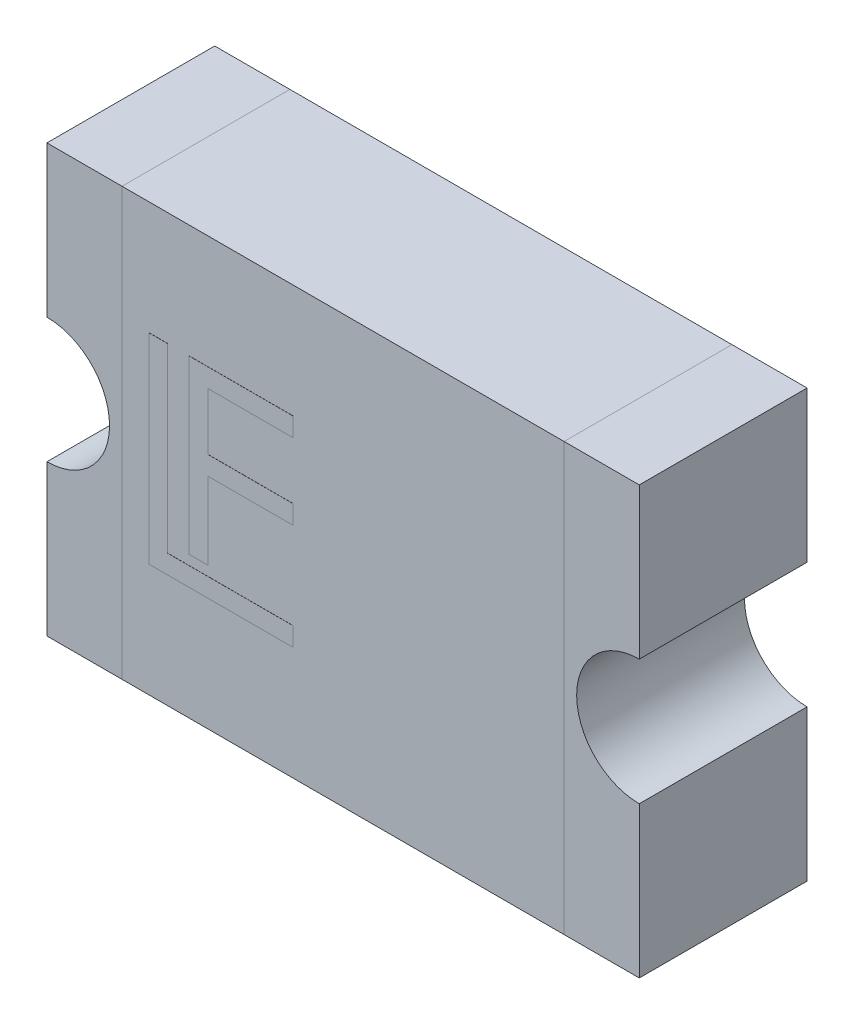
ISO-10303-21;
HEADER;
FILE_DESCRIPTION(('STEP AP214'),'2;1');
FILE_NAME('part.step','',(''),(''),'','','');
FILE_SCHEMA(('AUTOMOTIVE_DESIGN { 1 0 10303 214 1 1 1 1 }'));
ENDSEC;
DATA;
#1=APPLICATION_CONTEXT('core data for automotive mechanical design processes');
#2=APPLICATION_PROTOCOL_DEFINITION('international standard','automotive_design',2000,#1);
#3=PRODUCT_CONTEXT('',#1,'mechanical');
#4=PRODUCT('Part','Part','',(#3));
#5=PRODUCT_RELATED_PRODUCT_CATEGORY('part','',(#4));
#6=PRODUCT_DEFINITION_FORMATION('','',#4);
#7=PRODUCT_DEFINITION_CONTEXT('part definition',#1,'design');
#8=PRODUCT_DEFINITION('design','',#6,#7);
#9=PRODUCT_DEFINITION_SHAPE('','',#8);
#10=(LENGTH_UNIT() NAMED_UNIT(*) SI_UNIT(.MILLI.,.METRE.));
#11=(NAMED_UNIT(*) PLANE_ANGLE_UNIT() SI_UNIT($,.RADIAN.));
#12=(NAMED_UNIT(*) SI_UNIT($,.STERADIAN.) SOLID_ANGLE_UNIT());
#13=UNCERTAINTY_MEASURE_WITH_UNIT(LENGTH_MEASURE(1.E-05),#10,'distance_accuracy_value','');
#14=(GEOMETRIC_REPRESENTATION_CONTEXT(3) GLOBAL_UNCERTAINTY_ASSIGNED_CONTEXT((#13)) GLOBAL_UNIT_ASSIGNED_CONTEXT((#10,
#11,#12)) REPRESENTATION_CONTEXT('',''));
#15=CARTESIAN_POINT('',(0.,0.,0.));
#16=DIRECTION('',(0.,0.,1.));
#17=DIRECTION('',(1.,0.,0.));
#18=AXIS2_PLACEMENT_3D('',#15,#16,#17);
#19=CARTESIAN_POINT('',(-2.365,1.705,1.34));
#20=DIRECTION('',(1.,0.,0.));
#21=DIRECTION('',(0.,0.,-1.));
#22=AXIS2_PLACEMENT_3D('',#19,#20,#21);
#23=PLANE('',#22);
#24=DIRECTION('',(0.,0.,-1.));
#25=VECTOR('',#24,1.);
#26=CARTESIAN_POINT('',(-2.365,0.5,1.34));
#27=LINE('',#26,#25);
#28=CARTESIAN_POINT('',(-2.365,0.5,0.));
#29=VERTEX_POINT('',#28);
#30=CARTESIAN_POINT('',(-2.365,0.5,1.34));
#31=VERTEX_POINT('',#30);
#32=EDGE_CURVE('P0_E84',#29,#31,#27,.F.);
#33=ORIENTED_EDGE('',*,*,#32,.T.);
#34=DIRECTION('',(0.,1.,0.));
#35=VECTOR('',#34,1.);
#36=CARTESIAN_POINT('',(-2.365,0.,1.34));
#37=LINE('',#36,#35);
#38=CARTESIAN_POINT('',(-2.365,1.705,1.34));
#39=VERTEX_POINT('',#38);
#40=EDGE_CURVE('P0_E66',#39,#31,#37,.F.);
#41=ORIENTED_EDGE('',*,*,#40,.F.);
#42=DIRECTION('',(0.,0.,-1.));
#43=VECTOR('',#42,1.);
#44=CARTESIAN_POINT('',(-2.365,1.705,1.34));
#45=LINE('',#44,#43);
#46=CARTESIAN_POINT('',(-2.365,1.705,0.));
#47=VERTEX_POINT('',#46);
#48=EDGE_CURVE('P0_E111',#39,#47,#45,.T.);
#49=ORIENTED_EDGE('',*,*,#48,.T.);
#50=DIRECTION('',(0.,1.,0.));
#51=VECTOR('',#50,1.);
#52=CARTESIAN_POINT('',(-2.365,0.,0.));
#53=LINE('',#52,#51);
#54=EDGE_CURVE('P0_E114',#47,#29,#53,.F.);
#55=ORIENTED_EDGE('',*,*,#54,.T.);
#56=EDGE_LOOP('',(#33,#41,#49,#55));
#57=FACE_BOUND('',#56,.T.);
#58=ADVANCED_FACE('P0_F17',(#57),#23,.F.);
#59=CARTESIAN_POINT('',(-2.365,0.,1.34));
#60=DIRECTION('',(0.,0.,-1.));
#61=DIRECTION('',(-1.,0.,0.));
#62=AXIS2_PLACEMENT_3D('',#59,#60,#61);
#63=CYLINDRICAL_SURFACE('',#62,0.5);
#64=DIRECTION('',(0.,0.,-1.));
#65=VECTOR('',#64,1.);
#66=CARTESIAN_POINT('',(-2.365,-0.5,1.34));
#67=LINE('',#66,#65);
#68=CARTESIAN_POINT('',(-2.365,-0.5,0.));
#69=VERTEX_POINT('',#68);
#70=CARTESIAN_POINT('',(-2.365,-0.5,1.34));
#71=VERTEX_POINT('',#70);
#72=EDGE_CURVE('P0_E76',#69,#71,#67,.F.);
#73=ORIENTED_EDGE('',*,*,#72,.T.);
#74=CARTESIAN_POINT('',(-2.365,0.,1.34));
#75=DIRECTION('',(0.,0.,-1.));
#76=DIRECTION('',(-1.,0.,0.));
#77=AXIS2_PLACEMENT_3D('',#74,#75,#76);
#78=CIRCLE('',#77,0.5);
#79=EDGE_CURVE('P0_E20',#31,#71,#78,.T.);
#80=ORIENTED_EDGE('',*,*,#79,.F.);
#81=ORIENTED_EDGE('',*,*,#32,.F.);
#82=CARTESIAN_POINT('',(-2.365,0.,0.));
#83=DIRECTION('',(0.,0.,-1.));
#84=DIRECTION('',(-1.,0.,0.));
#85=AXIS2_PLACEMENT_3D('',#82,#83,#84);
#86=CIRCLE('',#85,0.5);
#87=EDGE_CURVE('P0_E79',#29,#69,#86,.T.);
#88=ORIENTED_EDGE('',*,*,#87,.T.);
#89=EDGE_LOOP('',(#73,#80,#81,#88));
#90=FACE_BOUND('',#89,.T.);
#91=ADVANCED_FACE('P0_F77',(#90),#63,.F.);
#92=CARTESIAN_POINT('',(-2.365,-0.5,1.34));
#93=DIRECTION('',(1.,0.,0.));
#94=DIRECTION('',(0.,0.,-1.));
#95=AXIS2_PLACEMENT_3D('',#92,#93,#94);
#96=PLANE('',#95);
#97=DIRECTION('',(0.,0.,1.));
#98=VECTOR('',#97,1.);
#99=CARTESIAN_POINT('',(-2.365,-1.705,1.34));
#100=LINE('',#99,#98);
#101=CARTESIAN_POINT('',(-2.365,-1.705,0.));
#102=VERTEX_POINT('',#101);
#103=CARTESIAN_POINT('',(-2.365,-1.705,1.34));
#104=VERTEX_POINT('',#103);
#105=EDGE_CURVE('P0_E83',#102,#104,#100,.T.);
#106=ORIENTED_EDGE('',*,*,#105,.T.);
#107=DIRECTION('',(0.,1.,0.));
#108=VECTOR('',#107,1.);
#109=CARTESIAN_POINT('',(-2.365,0.,1.34));
#110=LINE('',#109,#108);
#111=EDGE_CURVE('P0_E72',#71,#104,#110,.F.);
#112=ORIENTED_EDGE('',*,*,#111,.F.);
#113=ORIENTED_EDGE('',*,*,#72,.F.);
#114=DIRECTION('',(0.,1.,0.));
#115=VECTOR('',#114,1.);
#116=CARTESIAN_POINT('',(-2.365,0.,0.));
#117=LINE('',#116,#115);
#118=EDGE_CURVE('P0_E104',#69,#102,#117,.F.);
#119=ORIENTED_EDGE('',*,*,#118,.T.);
#120=EDGE_LOOP('',(#106,#112,#113,#119));
#121=FACE_BOUND('',#120,.T.);
#122=ADVANCED_FACE('P0_F86',(#121),#96,.F.);
#123=CARTESIAN_POINT('',(-1.765,-1.705,1.34));
#124=DIRECTION('',(0.,1.,0.));
#125=DIRECTION('',(0.,0.,1.));
#126=AXIS2_PLACEMENT_3D('',#123,#124,#125);
#127=PLANE('',#126);
#128=DIRECTION('',(0.,0.,1.));
#129=VECTOR('',#128,1.);
#130=CARTESIAN_POINT('',(-1.765,-1.705,1.34));
#131=LINE('',#130,#129);
#132=CARTESIAN_POINT('',(-1.765,-1.705,0.));
#133=VERTEX_POINT('',#132);
#134=CARTESIAN_POINT('',(-1.765,-1.705,1.34));
#135=VERTEX_POINT('',#134);
#136=EDGE_CURVE('P0_E118',#133,#135,#131,.T.);
#137=ORIENTED_EDGE('',*,*,#136,.T.);
#138=DIRECTION('',(1.,0.,0.));
#139=VECTOR('',#138,1.);
#140=CARTESIAN_POINT('',(-2.365,-1.705,1.34));
#141=LINE('',#140,#139);
#142=EDGE_CURVE('P0_E88',#104,#135,#141,.T.);
#143=ORIENTED_EDGE('',*,*,#142,.F.);
#144=ORIENTED_EDGE('',*,*,#105,.F.);
#145=DIRECTION('',(1.,0.,0.));
#146=VECTOR('',#145,1.);
#147=CARTESIAN_POINT('',(-2.365,-1.705,0.));
#148=LINE('',#147,#146);
#149=EDGE_CURVE('P0_E101',#102,#133,#148,.T.);
#150=ORIENTED_EDGE('',*,*,#149,.T.);
#151=EDGE_LOOP('',(#137,#143,#144,#150));
#152=FACE_BOUND('',#151,.T.);
#153=ADVANCED_FACE('P0_F142',(#152),#127,.F.);
#154=CARTESIAN_POINT('',(-2.365,0.,1.34));
#155=DIRECTION('',(0.,0.,1.));
#156=DIRECTION('',(1.,0.,0.));
#157=AXIS2_PLACEMENT_3D('',#154,#155,#156);
#158=PLANE('',#157);
#159=ORIENTED_EDGE('',*,*,#142,.T.);
#160=DIRECTION('',(0.,-1.,0.));
#161=VECTOR('',#160,1.);
#162=CARTESIAN_POINT('',(-1.765,-1.705,1.34));
#163=LINE('',#162,#161);
#164=CARTESIAN_POINT('',(-1.765,1.705,1.34));
#165=VERTEX_POINT('',#164);
#166=EDGE_CURVE('P0_E126',#135,#165,#163,.F.);
#167=ORIENTED_EDGE('',*,*,#166,.T.);
#168=DIRECTION('',(1.,0.,0.));
#169=VECTOR('',#168,1.);
#170=CARTESIAN_POINT('',(-1.765,1.705,1.34));
#171=LINE('',#170,#169);
#172=EDGE_CURVE('P0_E90',#165,#39,#171,.F.);
#173=ORIENTED_EDGE('',*,*,#172,.T.);
#174=ORIENTED_EDGE('',*,*,#40,.T.);
#175=ORIENTED_EDGE('',*,*,#79,.T.);
#176=ORIENTED_EDGE('',*,*,#111,.T.);
#177=EDGE_LOOP('',(#159,#167,#173,#174,#175,#176));
#178=FACE_BOUND('',#177,.T.);
#179=ADVANCED_FACE('P0_F70',(#178),#158,.T.);
#180=CARTESIAN_POINT('',(-1.765,1.705,1.34));
#181=DIRECTION('',(0.,-1.,0.));
#182=DIRECTION('',(0.,0.,-1.));
#183=AXIS2_PLACEMENT_3D('',#180,#181,#182);
#184=PLANE('',#183);
#185=ORIENTED_EDGE('',*,*,#48,.F.);
#186=ORIENTED_EDGE('',*,*,#172,.F.);
#187=DIRECTION('',(0.,0.,1.));
#188=VECTOR('',#187,1.);
#189=CARTESIAN_POINT('',(-1.765,1.705,1.34));
#190=LINE('',#189,#188);
#191=CARTESIAN_POINT('',(-1.765,1.705,0.));
#192=VERTEX_POINT('',#191);
#193=EDGE_CURVE('P0_E26',#165,#192,#190,.F.);
#194=ORIENTED_EDGE('',*,*,#193,.T.);
#195=DIRECTION('',(1.,0.,0.));
#196=VECTOR('',#195,1.);
#197=CARTESIAN_POINT('',(-2.365,1.705,0.));
#198=LINE('',#197,#196);
#199=EDGE_CURVE('P0_E34',#192,#47,#198,.F.);
#200=ORIENTED_EDGE('',*,*,#199,.T.);
#201=EDGE_LOOP('',(#185,#186,#194,#200));
#202=FACE_BOUND('',#201,.T.);
#203=ADVANCED_FACE('P0_F150',(#202),#184,.F.);
#204=CARTESIAN_POINT('',(-2.365,0.,0.));
#205=DIRECTION('',(0.,0.,1.));
#206=DIRECTION('',(1.,0.,0.));
#207=AXIS2_PLACEMENT_3D('',#204,#205,#206);
#208=PLANE('',#207);
#209=DIRECTION('',(0.,-1.,0.));
#210=VECTOR('',#209,1.);
#211=CARTESIAN_POINT('',(-1.765,-1.705,0.));
#212=LINE('',#211,#210);
#213=EDGE_CURVE('P0_E11',#192,#133,#212,.T.);
#214=ORIENTED_EDGE('',*,*,#213,.T.);
#215=ORIENTED_EDGE('',*,*,#149,.F.);
#216=ORIENTED_EDGE('',*,*,#118,.F.);
#217=ORIENTED_EDGE('',*,*,#87,.F.);
#218=ORIENTED_EDGE('',*,*,#54,.F.);
#219=ORIENTED_EDGE('',*,*,#199,.F.);
#220=EDGE_LOOP('',(#214,#215,#216,#217,#218,#219));
#221=FACE_BOUND('',#220,.T.);
#222=ADVANCED_FACE('P0_F151',(#221),#208,.F.);
#223=CARTESIAN_POINT('',(-1.765,-1.705,1.34));
#224=DIRECTION('',(-1.,0.,0.));
#225=DIRECTION('',(0.,-1.,0.));
#226=AXIS2_PLACEMENT_3D('',#223,#224,#225);
#227=PLANE('',#226);
#228=ORIENTED_EDGE('',*,*,#193,.F.);
#229=ORIENTED_EDGE('',*,*,#166,.F.);
#230=ORIENTED_EDGE('',*,*,#136,.F.);
#231=ORIENTED_EDGE('',*,*,#213,.F.);
#232=EDGE_LOOP('',(#228,#229,#230,#231));
#233=FACE_BOUND('',#232,.T.);
#234=ADVANCED_FACE('P0_F147',(#233),#227,.F.);
#235=CLOSED_SHELL('',(#58,#91,#122,#153,#179,#203,#222,#234));
#236=MANIFOLD_SOLID_BREP('P0_B1',#235);
#237=CARTESIAN_POINT('',(-1.765,-1.705,0.));
#238=DIRECTION('',(0.,0.,1.));
#239=DIRECTION('',(1.,0.,0.));
#240=AXIS2_PLACEMENT_3D('',#237,#238,#239);
#241=PLANE('',#240);
#242=DIRECTION('',(1.,0.,0.));
#243=VECTOR('',#242,1.);
#244=CARTESIAN_POINT('',(-1.765,1.705,0.));
#245=LINE('',#244,#243);
#246=CARTESIAN_POINT('',(-1.765,1.705,0.));
#247=VERTEX_POINT('',#246);
#248=CARTESIAN_POINT('',(1.765,1.705,0.));
#249=VERTEX_POINT('',#248);
#250=EDGE_CURVE('P1_E81',#247,#249,#245,.T.);
#251=ORIENTED_EDGE('',*,*,#250,.T.);
#252=DIRECTION('',(0.,-1.,0.));
#253=VECTOR('',#252,1.);
#254=CARTESIAN_POINT('',(1.765,1.705,0.));
#255=LINE('',#254,#253);
#256=CARTESIAN_POINT('',(1.765,-1.705,0.));
#257=VERTEX_POINT('',#256);
#258=EDGE_CURVE('P1_E68',#249,#257,#255,.T.);
#259=ORIENTED_EDGE('',*,*,#258,.T.);
#260=DIRECTION('',(1.,0.,0.));
#261=VECTOR('',#260,1.);
#262=CARTESIAN_POINT('',(-1.765,-1.705,0.));
#263=LINE('',#262,#261);
#264=CARTESIAN_POINT('',(-1.765,-1.705,0.));
#265=VERTEX_POINT('',#264);
#266=EDGE_CURVE('P1_E55',#257,#265,#263,.F.);
#267=ORIENTED_EDGE('',*,*,#266,.T.);
#268=DIRECTION('',(0.,1.,0.));
#269=VECTOR('',#268,1.);
#270=CARTESIAN_POINT('',(-1.765,1.705,0.));
#271=LINE('',#270,#269);
#272=EDGE_CURVE('P1_E20',#265,#247,#271,.T.);
#273=ORIENTED_EDGE('',*,*,#272,.T.);
#274=EDGE_LOOP('',(#251,#259,#267,#273));
#275=FACE_BOUND('',#274,.T.);
#276=ADVANCED_FACE('P1_F17',(#275),#241,.F.);
#277=CARTESIAN_POINT('',(-1.765,1.705,1.34));
#278=DIRECTION('',(1.,0.,0.));
#279=DIRECTION('',(0.,1.,0.));
#280=AXIS2_PLACEMENT_3D('',#277,#278,#279);
#281=PLANE('',#280);
#282=DIRECTION('',(0.,0.,1.));
#283=VECTOR('',#282,1.);
#284=CARTESIAN_POINT('',(-1.765,-1.705,1.34));
#285=LINE('',#284,#283);
#286=CARTESIAN_POINT('',(-1.765,-1.705,1.34));
#287=VERTEX_POINT('',#286);
#288=EDGE_CURVE('P1_E61',#265,#287,#285,.T.);
#289=ORIENTED_EDGE('',*,*,#288,.T.);
#290=DIRECTION('',(0.,1.,0.));
#291=VECTOR('',#290,1.);
#292=CARTESIAN_POINT('',(-1.765,-1.705,1.34));
#293=LINE('',#292,#291);
#294=CARTESIAN_POINT('',(-1.765,1.705,1.34));
#295=VERTEX_POINT('',#294);
#296=EDGE_CURVE('P1_E83',#295,#287,#293,.F.);
#297=ORIENTED_EDGE('',*,*,#296,.F.);
#298=DIRECTION('',(0.,0.,-1.));
#299=VECTOR('',#298,1.);
#300=CARTESIAN_POINT('',(-1.765,1.705,1.34));
#301=LINE('',#300,#299);
#302=EDGE_CURVE('P1_E64',#295,#247,#301,.T.);
#303=ORIENTED_EDGE('',*,*,#302,.T.);
#304=ORIENTED_EDGE('',*,*,#272,.F.);
#305=EDGE_LOOP('',(#289,#297,#303,#304));
#306=FACE_BOUND('',#305,.T.);
#307=ADVANCED_FACE('P1_F60',(#306),#281,.F.);
#308=CARTESIAN_POINT('',(-1.765,-1.705,1.34));
#309=DIRECTION('',(0.,1.,0.));
#310=DIRECTION('',(0.,0.,1.));
#311=AXIS2_PLACEMENT_3D('',#308,#309,#310);
#312=PLANE('',#311);
#313=DIRECTION('',(0.,0.,1.));
#314=VECTOR('',#313,1.);
#315=CARTESIAN_POINT('',(1.765,-1.705,1.34));
#316=LINE('',#315,#314);
#317=CARTESIAN_POINT('',(1.765,-1.705,1.34));
#318=VERTEX_POINT('',#317);
#319=EDGE_CURVE('P1_E70',#257,#318,#316,.T.);
#320=ORIENTED_EDGE('',*,*,#319,.T.);
#321=DIRECTION('',(1.,0.,0.));
#322=VECTOR('',#321,1.);
#323=CARTESIAN_POINT('',(-1.765,-1.705,1.34));
#324=LINE('',#323,#322);
#325=EDGE_CURVE('P1_E74',#287,#318,#324,.T.);
#326=ORIENTED_EDGE('',*,*,#325,.F.);
#327=ORIENTED_EDGE('',*,*,#288,.F.);
#328=ORIENTED_EDGE('',*,*,#266,.F.);
#329=EDGE_LOOP('',(#320,#326,#327,#328));
#330=FACE_BOUND('',#329,.T.);
#331=ADVANCED_FACE('P1_F72',(#330),#312,.F.);
#332=CARTESIAN_POINT('',(1.765,1.705,1.34));
#333=DIRECTION('',(-1.,0.,0.));
#334=DIRECTION('',(0.,-1.,0.));
#335=AXIS2_PLACEMENT_3D('',#332,#333,#334);
#336=PLANE('',#335);
#337=DIRECTION('',(0.,0.,-1.));
#338=VECTOR('',#337,1.);
#339=CARTESIAN_POINT('',(1.765,1.705,1.34));
#340=LINE('',#339,#338);
#341=CARTESIAN_POINT('',(1.765,1.705,1.34));
#342=VERTEX_POINT('',#341);
#343=EDGE_CURVE('P1_E35',#249,#342,#340,.F.);
#344=ORIENTED_EDGE('',*,*,#343,.T.);
#345=DIRECTION('',(0.,1.,0.));
#346=VECTOR('',#345,1.);
#347=CARTESIAN_POINT('',(1.765,-1.705,1.34));
#348=LINE('',#347,#346);
#349=EDGE_CURVE('P1_E26',#318,#342,#348,.T.);
#350=ORIENTED_EDGE('',*,*,#349,.F.);
#351=ORIENTED_EDGE('',*,*,#319,.F.);
#352=ORIENTED_EDGE('',*,*,#258,.F.);
#353=EDGE_LOOP('',(#344,#350,#351,#352));
#354=FACE_BOUND('',#353,.T.);
#355=ADVANCED_FACE('P1_F89',(#354),#336,.F.);
#356=CARTESIAN_POINT('',(-1.765,1.705,1.34));
#357=DIRECTION('',(0.,-1.,0.));
#358=DIRECTION('',(0.,0.,-1.));
#359=AXIS2_PLACEMENT_3D('',#356,#357,#358);
#360=PLANE('',#359);
#361=ORIENTED_EDGE('',*,*,#302,.F.);
#362=DIRECTION('',(1.,0.,0.));
#363=VECTOR('',#362,1.);
#364=CARTESIAN_POINT('',(-1.765,1.705,1.34));
#365=LINE('',#364,#363);
#366=EDGE_CURVE('P1_E11',#342,#295,#365,.F.);
#367=ORIENTED_EDGE('',*,*,#366,.F.);
#368=ORIENTED_EDGE('',*,*,#343,.F.);
#369=ORIENTED_EDGE('',*,*,#250,.F.);
#370=EDGE_LOOP('',(#361,#367,#368,#369));
#371=FACE_BOUND('',#370,.T.);
#372=ADVANCED_FACE('P1_F91',(#371),#360,.F.);
#373=CARTESIAN_POINT('',(-1.765,-1.705,1.34));
#374=DIRECTION('',(0.,0.,1.));
#375=DIRECTION('',(1.,0.,0.));
#376=AXIS2_PLACEMENT_3D('',#373,#374,#375);
#377=PLANE('',#376);
#378=ORIENTED_EDGE('',*,*,#349,.T.);
#379=ORIENTED_EDGE('',*,*,#366,.T.);
#380=ORIENTED_EDGE('',*,*,#296,.T.);
#381=ORIENTED_EDGE('',*,*,#325,.T.);
#382=EDGE_LOOP('',(#378,#379,#380,#381));
#383=FACE_BOUND('',#382,.T.);
#384=ADVANCED_FACE('P1_F88',(#383),#377,.T.);
#385=CLOSED_SHELL('',(#276,#307,#331,#355,#372,#384));
#386=MANIFOLD_SOLID_BREP('P1_B1',#385);
#387=CARTESIAN_POINT('',(-0.4,0.8,1.34));
#388=DIRECTION('',(0.,0.,-1.));
#389=DIRECTION('',(-1.,0.,0.));
#390=AXIS2_PLACEMENT_3D('',#387,#388,#389);
#391=PLANE('',#390);
#392=DIRECTION('',(1.,0.,0.));
#393=VECTOR('',#392,1.);
#394=CARTESIAN_POINT('',(-1.228413287018,-0.571292642216,1.34));
#395=LINE('',#394,#393);
#396=CARTESIAN_POINT('',(-1.078413287018,-0.571292642216,1.34));
#397=VERTEX_POINT('',#396);
#398=CARTESIAN_POINT('',(-1.228413287018,-0.571292642216,1.34));
#399=VERTEX_POINT('',#398);
#400=EDGE_CURVE('P2_E126',#397,#399,#395,.F.);
#401=ORIENTED_EDGE('',*,*,#400,.T.);
#402=DIRECTION('',(0.,1.,0.));
#403=VECTOR('',#402,1.);
#404=CARTESIAN_POINT('',(-1.228413287018,0.8,1.34));
#405=LINE('',#404,#403);
#406=CARTESIAN_POINT('',(-1.228413287018,0.8,1.34));
#407=VERTEX_POINT('',#406);
#408=EDGE_CURVE('P2_E119',#399,#407,#405,.T.);
#409=ORIENTED_EDGE('',*,*,#408,.T.);
#410=DIRECTION('',(1.,0.,0.));
#411=VECTOR('',#410,1.);
#412=CARTESIAN_POINT('',(-1.228413287018,0.8,1.34));
#413=LINE('',#412,#411);
#414=CARTESIAN_POINT('',(-0.4,0.8,1.34));
#415=VERTEX_POINT('',#414);
#416=EDGE_CURVE('P2_E113',#407,#415,#413,.T.);
#417=ORIENTED_EDGE('',*,*,#416,.T.);
#418=DIRECTION('',(0.,-1.,0.));
#419=VECTOR('',#418,1.);
#420=CARTESIAN_POINT('',(-0.4,0.8,1.34));
#421=LINE('',#420,#419);
#422=CARTESIAN_POINT('',(-0.4,0.65,1.34));
#423=VERTEX_POINT('',#422);
#424=EDGE_CURVE('P2_E99',#415,#423,#421,.T.);
#425=ORIENTED_EDGE('',*,*,#424,.T.);
#426=DIRECTION('',(1.,0.,0.));
#427=VECTOR('',#426,1.);
#428=CARTESIAN_POINT('',(-1.078413287018,0.65,1.34));
#429=LINE('',#428,#427);
#430=CARTESIAN_POINT('',(-1.078413287018,0.65,1.34));
#431=VERTEX_POINT('',#430);
#432=EDGE_CURVE('P2_E96',#423,#431,#429,.F.);
#433=ORIENTED_EDGE('',*,*,#432,.T.);
#434=DIRECTION('',(0.,1.,0.));
#435=VECTOR('',#434,1.);
#436=CARTESIAN_POINT('',(-1.078413287018,0.19403873626,1.34));
#437=LINE('',#436,#435);
#438=CARTESIAN_POINT('',(-1.078413287018,0.19403873626,1.34));
#439=VERTEX_POINT('',#438);
#440=EDGE_CURVE('P2_E153',#431,#439,#437,.F.);
#441=ORIENTED_EDGE('',*,*,#440,.T.);
#442=DIRECTION('',(1.,0.,0.));
#443=VECTOR('',#442,1.);
#444=CARTESIAN_POINT('',(-1.078413287018,0.19403873626,1.34));
#445=LINE('',#444,#443);
#446=CARTESIAN_POINT('',(-0.4,0.19403873626,1.34));
#447=VERTEX_POINT('',#446);
#448=EDGE_CURVE('P2_E149',#439,#447,#445,.T.);
#449=ORIENTED_EDGE('',*,*,#448,.T.);
#450=DIRECTION('',(0.,1.,0.));
#451=VECTOR('',#450,1.);
#452=CARTESIAN_POINT('',(-0.4,0.19403873626,1.34));
#453=LINE('',#452,#451);
#454=CARTESIAN_POINT('',(-0.4,0.04403873625961,1.34));
#455=VERTEX_POINT('',#454);
#456=EDGE_CURVE('P2_E144',#447,#455,#453,.F.);
#457=ORIENTED_EDGE('',*,*,#456,.T.);
#458=DIRECTION('',(1.,0.,0.));
#459=VECTOR('',#458,1.);
#460=CARTESIAN_POINT('',(-0.4,0.04403873625961,1.34));
#461=LINE('',#460,#459);
#462=CARTESIAN_POINT('',(-1.078413287018,0.04403873625961,1.34));
#463=VERTEX_POINT('',#462);
#464=EDGE_CURVE('P2_E138',#455,#463,#461,.F.);
#465=ORIENTED_EDGE('',*,*,#464,.T.);
#466=DIRECTION('',(0.,1.,0.));
#467=VECTOR('',#466,1.);
#468=CARTESIAN_POINT('',(-1.078413287018,0.04403873625961,1.34));
#469=LINE('',#468,#467);
#470=EDGE_CURVE('P2_E132',#463,#397,#469,.F.);
#471=ORIENTED_EDGE('',*,*,#470,.T.);
#472=EDGE_LOOP('',(#401,#409,#417,#425,#433,#441,#449,#457,#465,#471));
#473=FACE_BOUND('',#472,.T.);
#474=ADVANCED_FACE('P2_F17',(#473),#391,.T.);
#475=CARTESIAN_POINT('',(-0.4,0.8,1.341));
#476=DIRECTION('',(-1.,0.,0.));
#477=DIRECTION('',(0.,-1.,0.));
#478=AXIS2_PLACEMENT_3D('',#475,#476,#477);
#479=PLANE('',#478);
#480=DIRECTION('',(0.,0.,1.));
#481=VECTOR('',#480,1.);
#482=CARTESIAN_POINT('',(-0.4,0.8,1.341));
#483=LINE('',#482,#481);
#484=CARTESIAN_POINT('',(-0.4,0.8,1.341));
#485=VERTEX_POINT('',#484);
#486=EDGE_CURVE('P2_E112',#415,#485,#483,.T.);
#487=ORIENTED_EDGE('',*,*,#486,.T.);
#488=DIRECTION('',(0.,1.,0.));
#489=VECTOR('',#488,1.);
#490=CARTESIAN_POINT('',(-0.4,0.8,1.341));
#491=LINE('',#490,#489);
#492=CARTESIAN_POINT('',(-0.4,0.65,1.341));
#493=VERTEX_POINT('',#492);
#494=EDGE_CURVE('P2_E104',#485,#493,#491,.F.);
#495=ORIENTED_EDGE('',*,*,#494,.T.);
#496=DIRECTION('',(0.,0.,1.));
#497=VECTOR('',#496,1.);
#498=CARTESIAN_POINT('',(-0.4,0.65,1.341));
#499=LINE('',#498,#497);
#500=EDGE_CURVE('P2_E20',#493,#423,#499,.F.);
#501=ORIENTED_EDGE('',*,*,#500,.T.);
#502=ORIENTED_EDGE('',*,*,#424,.F.);
#503=EDGE_LOOP('',(#487,#495,#501,#502));
#504=FACE_BOUND('',#503,.T.);
#505=ADVANCED_FACE('P2_F110',(#504),#479,.F.);
#506=CARTESIAN_POINT('',(-1.078413287018,0.65,1.341));
#507=DIRECTION('',(0.,1.,0.));
#508=DIRECTION('',(0.,0.,1.));
#509=AXIS2_PLACEMENT_3D('',#506,#507,#508);
#510=PLANE('',#509);
#511=ORIENTED_EDGE('',*,*,#500,.F.);
#512=DIRECTION('',(-1.,0.,0.));
#513=VECTOR('',#512,1.);
#514=CARTESIAN_POINT('',(-0.4,0.65,1.341));
#515=LINE('',#514,#513);
#516=CARTESIAN_POINT('',(-1.078413287018,0.65,1.341));
#517=VERTEX_POINT('',#516);
#518=EDGE_CURVE('P2_E95',#493,#517,#515,.T.);
#519=ORIENTED_EDGE('',*,*,#518,.T.);
#520=DIRECTION('',(0.,0.,1.));
#521=VECTOR('',#520,1.);
#522=CARTESIAN_POINT('',(-1.078413287018,0.65,1.341));
#523=LINE('',#522,#521);
#524=EDGE_CURVE('P2_E154',#517,#431,#523,.F.);
#525=ORIENTED_EDGE('',*,*,#524,.T.);
#526=ORIENTED_EDGE('',*,*,#432,.F.);
#527=EDGE_LOOP('',(#511,#519,#525,#526));
#528=FACE_BOUND('',#527,.T.);
#529=ADVANCED_FACE('P2_F93',(#528),#510,.F.);
#530=CARTESIAN_POINT('',(-1.078413287018,0.19403873626,1.341));
#531=DIRECTION('',(-1.,0.,0.));
#532=DIRECTION('',(0.,0.,1.));
#533=AXIS2_PLACEMENT_3D('',#530,#531,#532);
#534=PLANE('',#533);
#535=ORIENTED_EDGE('',*,*,#524,.F.);
#536=DIRECTION('',(0.,1.,0.));
#537=VECTOR('',#536,1.);
#538=CARTESIAN_POINT('',(-1.078413287018,0.8,1.341));
#539=LINE('',#538,#537);
#540=CARTESIAN_POINT('',(-1.078413287018,0.19403873626,1.341));
#541=VERTEX_POINT('',#540);
#542=EDGE_CURVE('P2_E108',#517,#541,#539,.F.);
#543=ORIENTED_EDGE('',*,*,#542,.T.);
#544=DIRECTION('',(0.,0.,1.));
#545=VECTOR('',#544,1.);
#546=CARTESIAN_POINT('',(-1.078413287018,0.19403873626,1.341));
#547=LINE('',#546,#545);
#548=EDGE_CURVE('P2_E151',#541,#439,#547,.F.);
#549=ORIENTED_EDGE('',*,*,#548,.T.);
#550=ORIENTED_EDGE('',*,*,#440,.F.);
#551=EDGE_LOOP('',(#535,#543,#549,#550));
#552=FACE_BOUND('',#551,.T.);
#553=ADVANCED_FACE('P2_F174',(#552),#534,.F.);
#554=CARTESIAN_POINT('',(-1.078413287018,0.19403873626,1.341));
#555=DIRECTION('',(0.,-1.,0.));
#556=DIRECTION('',(1.,0.,0.));
#557=AXIS2_PLACEMENT_3D('',#554,#555,#556);
#558=PLANE('',#557);
#559=ORIENTED_EDGE('',*,*,#548,.F.);
#560=DIRECTION('',(-1.,0.,0.));
#561=VECTOR('',#560,1.);
#562=CARTESIAN_POINT('',(-0.4,0.19403873626,1.341));
#563=LINE('',#562,#561);
#564=CARTESIAN_POINT('',(-0.4,0.19403873626,1.341));
#565=VERTEX_POINT('',#564);
#566=EDGE_CURVE('P2_E143',#541,#565,#563,.F.);
#567=ORIENTED_EDGE('',*,*,#566,.T.);
#568=DIRECTION('',(0.,0.,1.));
#569=VECTOR('',#568,1.);
#570=CARTESIAN_POINT('',(-0.4,0.19403873626,1.341));
#571=LINE('',#570,#569);
#572=EDGE_CURVE('P2_E146',#565,#447,#571,.F.);
#573=ORIENTED_EDGE('',*,*,#572,.T.);
#574=ORIENTED_EDGE('',*,*,#448,.F.);
#575=EDGE_LOOP('',(#559,#567,#573,#574));
#576=FACE_BOUND('',#575,.T.);
#577=ADVANCED_FACE('P2_F179',(#576),#558,.F.);
#578=CARTESIAN_POINT('',(-0.4,0.19403873626,1.341));
#579=DIRECTION('',(-1.,0.,0.));
#580=DIRECTION('',(0.,0.,1.));
#581=AXIS2_PLACEMENT_3D('',#578,#579,#580);
#582=PLANE('',#581);
#583=ORIENTED_EDGE('',*,*,#572,.F.);
#584=DIRECTION('',(0.,1.,0.));
#585=VECTOR('',#584,1.);
#586=CARTESIAN_POINT('',(-0.4,0.8,1.341));
#587=LINE('',#586,#585);
#588=CARTESIAN_POINT('',(-0.4,0.04403873625961,1.341));
#589=VERTEX_POINT('',#588);
#590=EDGE_CURVE('P2_E137',#565,#589,#587,.F.);
#591=ORIENTED_EDGE('',*,*,#590,.T.);
#592=DIRECTION('',(0.,0.,1.));
#593=VECTOR('',#592,1.);
#594=CARTESIAN_POINT('',(-0.4,0.04403873625961,1.341));
#595=LINE('',#594,#593);
#596=EDGE_CURVE('P2_E140',#589,#455,#595,.F.);
#597=ORIENTED_EDGE('',*,*,#596,.T.);
#598=ORIENTED_EDGE('',*,*,#456,.F.);
#599=EDGE_LOOP('',(#583,#591,#597,#598));
#600=FACE_BOUND('',#599,.T.);
#601=ADVANCED_FACE('P2_F182',(#600),#582,.F.);
#602=CARTESIAN_POINT('',(-0.4,0.04403873625961,1.341));
#603=DIRECTION('',(0.,1.,0.));
#604=DIRECTION('',(0.,0.,1.));
#605=AXIS2_PLACEMENT_3D('',#602,#603,#604);
#606=PLANE('',#605);
#607=ORIENTED_EDGE('',*,*,#596,.F.);
#608=DIRECTION('',(-1.,0.,0.));
#609=VECTOR('',#608,1.);
#610=CARTESIAN_POINT('',(-0.4,0.04403873625961,1.341));
#611=LINE('',#610,#609);
#612=CARTESIAN_POINT('',(-1.078413287018,0.04403873625961,1.341));
#613=VERTEX_POINT('',#612);
#614=EDGE_CURVE('P2_E131',#589,#613,#611,.T.);
#615=ORIENTED_EDGE('',*,*,#614,.T.);
#616=DIRECTION('',(0.,0.,1.));
#617=VECTOR('',#616,1.);
#618=CARTESIAN_POINT('',(-1.078413287018,0.04403873625961,1.341));
#619=LINE('',#618,#617);
#620=EDGE_CURVE('P2_E134',#613,#463,#619,.F.);
#621=ORIENTED_EDGE('',*,*,#620,.T.);
#622=ORIENTED_EDGE('',*,*,#464,.F.);
#623=EDGE_LOOP('',(#607,#615,#621,#622));
#624=FACE_BOUND('',#623,.T.);
#625=ADVANCED_FACE('P2_F187',(#624),#606,.F.);
#626=CARTESIAN_POINT('',(-1.078413287018,0.04403873625961,1.341));
#627=DIRECTION('',(-1.,0.,0.));
#628=DIRECTION('',(0.,0.,1.));
#629=AXIS2_PLACEMENT_3D('',#626,#627,#628);
#630=PLANE('',#629);
#631=ORIENTED_EDGE('',*,*,#620,.F.);
#632=DIRECTION('',(0.,1.,0.));
#633=VECTOR('',#632,1.);
#634=CARTESIAN_POINT('',(-1.078413287018,0.8,1.341));
#635=LINE('',#634,#633);
#636=CARTESIAN_POINT('',(-1.078413287018,-0.571292642216,1.341));
#637=VERTEX_POINT('',#636);
#638=EDGE_CURVE('P2_E125',#613,#637,#635,.F.);
#639=ORIENTED_EDGE('',*,*,#638,.T.);
#640=DIRECTION('',(0.,0.,1.));
#641=VECTOR('',#640,1.);
#642=CARTESIAN_POINT('',(-1.078413287018,-0.571292642216,1.341));
#643=LINE('',#642,#641);
#644=EDGE_CURVE('P2_E128',#637,#397,#643,.F.);
#645=ORIENTED_EDGE('',*,*,#644,.T.);
#646=ORIENTED_EDGE('',*,*,#470,.F.);
#647=EDGE_LOOP('',(#631,#639,#645,#646));
#648=FACE_BOUND('',#647,.T.);
#649=ADVANCED_FACE('P2_F192',(#648),#630,.F.);
#650=CARTESIAN_POINT('',(-1.228413287018,-0.571292642216,1.341));
#651=DIRECTION('',(0.,1.,0.));
#652=DIRECTION('',(0.,0.,1.));
#653=AXIS2_PLACEMENT_3D('',#650,#651,#652);
#654=PLANE('',#653);
#655=ORIENTED_EDGE('',*,*,#644,.F.);
#656=DIRECTION('',(-1.,0.,0.));
#657=VECTOR('',#656,1.);
#658=CARTESIAN_POINT('',(-0.4,-0.571292642216,1.341));
#659=LINE('',#658,#657);
#660=CARTESIAN_POINT('',(-1.228413287018,-0.571292642216,1.341));
#661=VERTEX_POINT('',#660);
#662=EDGE_CURVE('P2_E122',#637,#661,#659,.T.);
#663=ORIENTED_EDGE('',*,*,#662,.T.);
#664=DIRECTION('',(0.,0.,1.));
#665=VECTOR('',#664,1.);
#666=CARTESIAN_POINT('',(-1.228413287018,-0.571292642216,1.341));
#667=LINE('',#666,#665);
#668=EDGE_CURVE('P2_E121',#661,#399,#667,.F.);
#669=ORIENTED_EDGE('',*,*,#668,.T.);
#670=ORIENTED_EDGE('',*,*,#400,.F.);
#671=EDGE_LOOP('',(#655,#663,#669,#670));
#672=FACE_BOUND('',#671,.T.);
#673=ADVANCED_FACE('P2_F194',(#672),#654,.F.);
#674=CARTESIAN_POINT('',(-1.228413287018,0.8,1.341));
#675=DIRECTION('',(1.,0.,0.));
#676=DIRECTION('',(0.,0.,-1.));
#677=AXIS2_PLACEMENT_3D('',#674,#675,#676);
#678=PLANE('',#677);
#679=ORIENTED_EDGE('',*,*,#668,.F.);
#680=DIRECTION('',(0.,1.,0.));
#681=VECTOR('',#680,1.);
#682=CARTESIAN_POINT('',(-1.228413287018,0.8,1.341));
#683=LINE('',#682,#681);
#684=CARTESIAN_POINT('',(-1.228413287018,0.8,1.341));
#685=VERTEX_POINT('',#684);
#686=EDGE_CURVE('P2_E26',#661,#685,#683,.T.);
#687=ORIENTED_EDGE('',*,*,#686,.T.);
#688=DIRECTION('',(0.,0.,-1.));
#689=VECTOR('',#688,1.);
#690=CARTESIAN_POINT('',(-1.228413287018,0.8,1.341));
#691=LINE('',#690,#689);
#692=EDGE_CURVE('P2_E34',#685,#407,#691,.T.);
#693=ORIENTED_EDGE('',*,*,#692,.T.);
#694=ORIENTED_EDGE('',*,*,#408,.F.);
#695=EDGE_LOOP('',(#679,#687,#693,#694));
#696=FACE_BOUND('',#695,.T.);
#697=ADVANCED_FACE('P2_F197',(#696),#678,.F.);
#698=CARTESIAN_POINT('',(-1.228413287018,0.8,1.341));
#699=DIRECTION('',(0.,-1.,0.));
#700=DIRECTION('',(0.,0.,-1.));
#701=AXIS2_PLACEMENT_3D('',#698,#699,#700);
#702=PLANE('',#701);
#703=ORIENTED_EDGE('',*,*,#692,.F.);
#704=DIRECTION('',(-1.,0.,0.));
#705=VECTOR('',#704,1.);
#706=CARTESIAN_POINT('',(-0.4,0.8,1.341));
#707=LINE('',#706,#705);
#708=EDGE_CURVE('P2_E11',#685,#485,#707,.F.);
#709=ORIENTED_EDGE('',*,*,#708,.T.);
#710=ORIENTED_EDGE('',*,*,#486,.F.);
#711=ORIENTED_EDGE('',*,*,#416,.F.);
#712=EDGE_LOOP('',(#703,#709,#710,#711));
#713=FACE_BOUND('',#712,.T.);
#714=ADVANCED_FACE('P2_F199',(#713),#702,.F.);
#715=CARTESIAN_POINT('',(-0.4,0.8,1.341));
#716=DIRECTION('',(0.,0.,-1.));
#717=DIRECTION('',(-1.,0.,0.));
#718=AXIS2_PLACEMENT_3D('',#715,#716,#717);
#719=PLANE('',#718);
#720=ORIENTED_EDGE('',*,*,#686,.F.);
#721=ORIENTED_EDGE('',*,*,#662,.F.);
#722=ORIENTED_EDGE('',*,*,#638,.F.);
#723=ORIENTED_EDGE('',*,*,#614,.F.);
#724=ORIENTED_EDGE('',*,*,#590,.F.);
#725=ORIENTED_EDGE('',*,*,#566,.F.);
#726=ORIENTED_EDGE('',*,*,#542,.F.);
#727=ORIENTED_EDGE('',*,*,#518,.F.);
#728=ORIENTED_EDGE('',*,*,#494,.F.);
#729=ORIENTED_EDGE('',*,*,#708,.F.);
#730=EDGE_LOOP('',(#720,#721,#722,#723,#724,#725,#726,#727,#728,#729));
#731=FACE_BOUND('',#730,.T.);
#732=ADVANCED_FACE('P2_F103',(#731),#719,.F.);
#733=CLOSED_SHELL('',(#474,#505,#529,#553,#577,#601,#625,#649,#673,#697,#714,#732));
#734=MANIFOLD_SOLID_BREP('P2_B1',#733);
#735=CARTESIAN_POINT('',(-1.400268296717,0.8,1.34));
#736=DIRECTION('',(0.,0.,-1.));
#737=DIRECTION('',(-1.,0.,0.));
#738=AXIS2_PLACEMENT_3D('',#735,#736,#737);
#739=PLANE('',#738);
#740=DIRECTION('',(-1.,0.,0.));
#741=VECTOR('',#740,1.);
#742=CARTESIAN_POINT('',(-1.550268296717,-0.8,1.34));
#743=LINE('',#742,#741);
#744=CARTESIAN_POINT('',(-0.4,-0.8,1.34));
#745=VERTEX_POINT('',#744);
#746=CARTESIAN_POINT('',(-1.550268296717,-0.8,1.34));
#747=VERTEX_POINT('',#746);
#748=EDGE_CURVE('P3_E100',#745,#747,#743,.T.);
#749=ORIENTED_EDGE('',*,*,#748,.T.);
#750=DIRECTION('',(0.,1.,0.));
#751=VECTOR('',#750,1.);
#752=CARTESIAN_POINT('',(-1.550268296717,0.8,1.34));
#753=LINE('',#752,#751);
#754=CARTESIAN_POINT('',(-1.550268296717,0.8,1.34));
#755=VERTEX_POINT('',#754);
#756=EDGE_CURVE('P3_E93',#747,#755,#753,.T.);
#757=ORIENTED_EDGE('',*,*,#756,.T.);
#758=DIRECTION('',(-1.,0.,0.));
#759=VECTOR('',#758,1.);
#760=CARTESIAN_POINT('',(-1.400268296717,0.8,1.34));
#761=LINE('',#760,#759);
#762=CARTESIAN_POINT('',(-1.400268296717,0.8,1.34));
#763=VERTEX_POINT('',#762);
#764=EDGE_CURVE('P3_E110',#755,#763,#761,.F.);
#765=ORIENTED_EDGE('',*,*,#764,.T.);
#766=DIRECTION('',(0.,1.,0.));
#767=VECTOR('',#766,1.);
#768=CARTESIAN_POINT('',(-1.400268296717,0.8,1.34));
#769=LINE('',#768,#767);
#770=CARTESIAN_POINT('',(-1.400268296717,-0.65,1.34));
#771=VERTEX_POINT('',#770);
#772=EDGE_CURVE('P3_E75',#763,#771,#769,.F.);
#773=ORIENTED_EDGE('',*,*,#772,.T.);
#774=DIRECTION('',(1.,0.,0.));
#775=VECTOR('',#774,1.);
#776=CARTESIAN_POINT('',(-1.400268296717,-0.65,1.34));
#777=LINE('',#776,#775);
#778=CARTESIAN_POINT('',(-0.4,-0.65,1.34));
#779=VERTEX_POINT('',#778);
#780=EDGE_CURVE('P3_E71',#771,#779,#777,.T.);
#781=ORIENTED_EDGE('',*,*,#780,.T.);
#782=DIRECTION('',(0.,-1.,0.));
#783=VECTOR('',#782,1.);
#784=CARTESIAN_POINT('',(-0.4,-0.8,1.34));
#785=LINE('',#784,#783);
#786=EDGE_CURVE('P3_E104',#779,#745,#785,.T.);
#787=ORIENTED_EDGE('',*,*,#786,.T.);
#788=EDGE_LOOP('',(#749,#757,#765,#773,#781,#787));
#789=FACE_BOUND('',#788,.T.);
#790=ADVANCED_FACE('P3_F17',(#789),#739,.T.);
#791=CARTESIAN_POINT('',(-1.400268296717,0.8,1.341));
#792=DIRECTION('',(-1.,0.,0.));
#793=DIRECTION('',(0.,0.,1.));
#794=AXIS2_PLACEMENT_3D('',#791,#792,#793);
#795=PLANE('',#794);
#796=DIRECTION('',(0.,0.,1.));
#797=VECTOR('',#796,1.);
#798=CARTESIAN_POINT('',(-1.400268296717,0.8,1.341));
#799=LINE('',#798,#797);
#800=CARTESIAN_POINT('',(-1.400268296717,0.8,1.341));
#801=VERTEX_POINT('',#800);
#802=EDGE_CURVE('P3_E88',#763,#801,#799,.T.);
#803=ORIENTED_EDGE('',*,*,#802,.T.);
#804=DIRECTION('',(0.,1.,0.));
#805=VECTOR('',#804,1.);
#806=CARTESIAN_POINT('',(-1.400268296717,0.8,1.341));
#807=LINE('',#806,#805);
#808=CARTESIAN_POINT('',(-1.400268296717,-0.65,1.341));
#809=VERTEX_POINT('',#808);
#810=EDGE_CURVE('P3_E80',#801,#809,#807,.F.);
#811=ORIENTED_EDGE('',*,*,#810,.T.);
#812=DIRECTION('',(0.,0.,1.));
#813=VECTOR('',#812,1.);
#814=CARTESIAN_POINT('',(-1.400268296717,-0.65,1.341));
#815=LINE('',#814,#813);
#816=EDGE_CURVE('P3_E20',#809,#771,#815,.F.);
#817=ORIENTED_EDGE('',*,*,#816,.T.);
#818=ORIENTED_EDGE('',*,*,#772,.F.);
#819=EDGE_LOOP('',(#803,#811,#817,#818));
#820=FACE_BOUND('',#819,.T.);
#821=ADVANCED_FACE('P3_F86',(#820),#795,.F.);
#822=CARTESIAN_POINT('',(-1.400268296717,-0.65,1.341));
#823=DIRECTION('',(0.,-1.,0.));
#824=DIRECTION('',(0.,0.,-1.));
#825=AXIS2_PLACEMENT_3D('',#822,#823,#824);
#826=PLANE('',#825);
#827=ORIENTED_EDGE('',*,*,#816,.F.);
#828=DIRECTION('',(-1.,0.,0.));
#829=VECTOR('',#828,1.);
#830=CARTESIAN_POINT('',(-1.400268296717,-0.65,1.341));
#831=LINE('',#830,#829);
#832=CARTESIAN_POINT('',(-0.4,-0.65,1.341));
#833=VERTEX_POINT('',#832);
#834=EDGE_CURVE('P3_E70',#809,#833,#831,.F.);
#835=ORIENTED_EDGE('',*,*,#834,.T.);
#836=DIRECTION('',(0.,0.,-1.));
#837=VECTOR('',#836,1.);
#838=CARTESIAN_POINT('',(-0.4,-0.65,1.341));
#839=LINE('',#838,#837);
#840=EDGE_CURVE('P3_E105',#833,#779,#839,.T.);
#841=ORIENTED_EDGE('',*,*,#840,.T.);
#842=ORIENTED_EDGE('',*,*,#780,.F.);
#843=EDGE_LOOP('',(#827,#835,#841,#842));
#844=FACE_BOUND('',#843,.T.);
#845=ADVANCED_FACE('P3_F68',(#844),#826,.F.);
#846=CARTESIAN_POINT('',(-0.4,-0.8,1.341));
#847=DIRECTION('',(-1.,0.,0.));
#848=DIRECTION('',(0.,-1.,0.));
#849=AXIS2_PLACEMENT_3D('',#846,#847,#848);
#850=PLANE('',#849);
#851=ORIENTED_EDGE('',*,*,#840,.F.);
#852=DIRECTION('',(0.,1.,0.));
#853=VECTOR('',#852,1.);
#854=CARTESIAN_POINT('',(-0.4,0.8,1.341));
#855=LINE('',#854,#853);
#856=CARTESIAN_POINT('',(-0.4,-0.8,1.341));
#857=VERTEX_POINT('',#856);
#858=EDGE_CURVE('P3_E84',#833,#857,#855,.F.);
#859=ORIENTED_EDGE('',*,*,#858,.T.);
#860=DIRECTION('',(0.,0.,1.));
#861=VECTOR('',#860,1.);
#862=CARTESIAN_POINT('',(-0.4,-0.8,1.341));
#863=LINE('',#862,#861);
#864=EDGE_CURVE('P3_E102',#857,#745,#863,.F.);
#865=ORIENTED_EDGE('',*,*,#864,.T.);
#866=ORIENTED_EDGE('',*,*,#786,.F.);
#867=EDGE_LOOP('',(#851,#859,#865,#866));
#868=FACE_BOUND('',#867,.T.);
#869=ADVANCED_FACE('P3_F118',(#868),#850,.F.);
#870=CARTESIAN_POINT('',(-1.550268296717,-0.8,1.341));
#871=DIRECTION('',(0.,1.,0.));
#872=DIRECTION('',(-1.,0.,0.));
#873=AXIS2_PLACEMENT_3D('',#870,#871,#872);
#874=PLANE('',#873);
#875=ORIENTED_EDGE('',*,*,#864,.F.);
#876=DIRECTION('',(-1.,0.,0.));
#877=VECTOR('',#876,1.);
#878=CARTESIAN_POINT('',(-1.400268296717,-0.8,1.341));
#879=LINE('',#878,#877);
#880=CARTESIAN_POINT('',(-1.550268296717,-0.8,1.341));
#881=VERTEX_POINT('',#880);
#882=EDGE_CURVE('P3_E97',#857,#881,#879,.T.);
#883=ORIENTED_EDGE('',*,*,#882,.T.);
#884=DIRECTION('',(0.,0.,1.));
#885=VECTOR('',#884,1.);
#886=CARTESIAN_POINT('',(-1.550268296717,-0.8,1.341));
#887=LINE('',#886,#885);
#888=EDGE_CURVE('P3_E96',#881,#747,#887,.F.);
#889=ORIENTED_EDGE('',*,*,#888,.T.);
#890=ORIENTED_EDGE('',*,*,#748,.F.);
#891=EDGE_LOOP('',(#875,#883,#889,#890));
#892=FACE_BOUND('',#891,.T.);
#893=ADVANCED_FACE('P3_F123',(#892),#874,.F.);
#894=CARTESIAN_POINT('',(-1.550268296717,0.8,1.341));
#895=DIRECTION('',(1.,0.,0.));
#896=DIRECTION('',(0.,1.,0.));
#897=AXIS2_PLACEMENT_3D('',#894,#895,#896);
#898=PLANE('',#897);
#899=ORIENTED_EDGE('',*,*,#888,.F.);
#900=DIRECTION('',(0.,1.,0.));
#901=VECTOR('',#900,1.);
#902=CARTESIAN_POINT('',(-1.550268296717,0.8,1.341));
#903=LINE('',#902,#901);
#904=CARTESIAN_POINT('',(-1.550268296717,0.8,1.341));
#905=VERTEX_POINT('',#904);
#906=EDGE_CURVE('P3_E26',#881,#905,#903,.T.);
#907=ORIENTED_EDGE('',*,*,#906,.T.);
#908=DIRECTION('',(0.,0.,1.));
#909=VECTOR('',#908,1.);
#910=CARTESIAN_POINT('',(-1.550268296717,0.8,1.341));
#911=LINE('',#910,#909);
#912=EDGE_CURVE('P3_E34',#905,#755,#911,.F.);
#913=ORIENTED_EDGE('',*,*,#912,.T.);
#914=ORIENTED_EDGE('',*,*,#756,.F.);
#915=EDGE_LOOP('',(#899,#907,#913,#914));
#916=FACE_BOUND('',#915,.T.);
#917=ADVANCED_FACE('P3_F126',(#916),#898,.F.);
#918=CARTESIAN_POINT('',(-1.550268296717,0.8,1.341));
#919=DIRECTION('',(0.,-1.,0.));
#920=DIRECTION('',(0.,0.,-1.));
#921=AXIS2_PLACEMENT_3D('',#918,#919,#920);
#922=PLANE('',#921);
#923=ORIENTED_EDGE('',*,*,#912,.F.);
#924=DIRECTION('',(-1.,0.,0.));
#925=VECTOR('',#924,1.);
#926=CARTESIAN_POINT('',(-1.400268296717,0.8,1.341));
#927=LINE('',#926,#925);
#928=EDGE_CURVE('P3_E11',#905,#801,#927,.F.);
#929=ORIENTED_EDGE('',*,*,#928,.T.);
#930=ORIENTED_EDGE('',*,*,#802,.F.);
#931=ORIENTED_EDGE('',*,*,#764,.F.);
#932=EDGE_LOOP('',(#923,#929,#930,#931));
#933=FACE_BOUND('',#932,.T.);
#934=ADVANCED_FACE('P3_F127',(#933),#922,.F.);
#935=CARTESIAN_POINT('',(-1.400268296717,0.8,1.341));
#936=DIRECTION('',(0.,0.,-1.));
#937=DIRECTION('',(-1.,0.,0.));
#938=AXIS2_PLACEMENT_3D('',#935,#936,#937);
#939=PLANE('',#938);
#940=ORIENTED_EDGE('',*,*,#906,.F.);
#941=ORIENTED_EDGE('',*,*,#882,.F.);
#942=ORIENTED_EDGE('',*,*,#858,.F.);
#943=ORIENTED_EDGE('',*,*,#834,.F.);
#944=ORIENTED_EDGE('',*,*,#810,.F.);
#945=ORIENTED_EDGE('',*,*,#928,.F.);
#946=EDGE_LOOP('',(#940,#941,#942,#943,#944,#945));
#947=FACE_BOUND('',#946,.T.);
#948=ADVANCED_FACE('P3_F79',(#947),#939,.F.);
#949=CLOSED_SHELL('',(#790,#821,#845,#869,#893,#917,#934,#948));
#950=MANIFOLD_SOLID_BREP('P3_B1',#949);
#951=CARTESIAN_POINT('',(2.365,-0.5,1.34));
#952=DIRECTION('',(-1.,0.,0.));
#953=DIRECTION('',(0.,0.,1.));
#954=AXIS2_PLACEMENT_3D('',#951,#952,#953);
#955=PLANE('',#954);
#956=DIRECTION('',(0.,0.,1.));
#957=VECTOR('',#956,1.);
#958=CARTESIAN_POINT('',(2.365,-0.5,1.34));
#959=LINE('',#958,#957);
#960=CARTESIAN_POINT('',(2.365,-0.5,1.34));
#961=VERTEX_POINT('',#960);
#962=CARTESIAN_POINT('',(2.365,-0.5,0.));
#963=VERTEX_POINT('',#962);
#964=EDGE_CURVE('P4_E66',#961,#963,#959,.F.);
#965=ORIENTED_EDGE('',*,*,#964,.F.);
#966=DIRECTION('',(0.,1.,0.));
#967=VECTOR('',#966,1.);
#968=CARTESIAN_POINT('',(2.365,0.,1.34));
#969=LINE('',#968,#967);
#970=CARTESIAN_POINT('',(2.365,-1.705,1.34));
#971=VERTEX_POINT('',#970);
#972=EDGE_CURVE('P4_E69',#961,#971,#969,.F.);
#973=ORIENTED_EDGE('',*,*,#972,.T.);
#974=DIRECTION('',(0.,0.,1.));
#975=VECTOR('',#974,1.);
#976=CARTESIAN_POINT('',(2.365,-1.705,1.34));
#977=LINE('',#976,#975);
#978=CARTESIAN_POINT('',(2.365,-1.705,0.));
#979=VERTEX_POINT('',#978);
#980=EDGE_CURVE('P4_E92',#971,#979,#977,.F.);
#981=ORIENTED_EDGE('',*,*,#980,.T.);
#982=DIRECTION('',(0.,1.,0.));
#983=VECTOR('',#982,1.);
#984=CARTESIAN_POINT('',(2.365,0.,0.));
#985=LINE('',#984,#983);
#986=EDGE_CURVE('P4_E71',#963,#979,#985,.F.);
#987=ORIENTED_EDGE('',*,*,#986,.F.);
#988=EDGE_LOOP('',(#965,#973,#981,#987));
#989=FACE_BOUND('',#988,.T.);
#990=ADVANCED_FACE('P4_F17',(#989),#955,.F.);
#991=CARTESIAN_POINT('',(2.365,1.705,1.34));
#992=DIRECTION('',(-1.,0.,0.));
#993=DIRECTION('',(0.,0.,1.));
#994=AXIS2_PLACEMENT_3D('',#991,#992,#993);
#995=PLANE('',#994);
#996=DIRECTION('',(0.,0.,-1.));
#997=VECTOR('',#996,1.);
#998=CARTESIAN_POINT('',(2.365,1.705,1.34));
#999=LINE('',#998,#997);
#1000=CARTESIAN_POINT('',(2.365,1.705,0.));
#1001=VERTEX_POINT('',#1000);
#1002=CARTESIAN_POINT('',(2.365,1.705,1.34));
#1003=VERTEX_POINT('',#1002);
#1004=EDGE_CURVE('P4_E86',#1001,#1003,#999,.F.);
#1005=ORIENTED_EDGE('',*,*,#1004,.T.);
#1006=DIRECTION('',(0.,1.,0.));
#1007=VECTOR('',#1006,1.);
#1008=CARTESIAN_POINT('',(2.365,0.,1.34));
#1009=LINE('',#1008,#1007);
#1010=CARTESIAN_POINT('',(2.365,0.5,1.34));
#1011=VERTEX_POINT('',#1010);
#1012=EDGE_CURVE('P4_E91',#1003,#1011,#1009,.F.);
#1013=ORIENTED_EDGE('',*,*,#1012,.T.);
#1014=DIRECTION('',(0.,0.,-1.));
#1015=VECTOR('',#1014,1.);
#1016=CARTESIAN_POINT('',(2.365,0.5,1.34));
#1017=LINE('',#1016,#1015);
#1018=CARTESIAN_POINT('',(2.365,0.5,0.));
#1019=VERTEX_POINT('',#1018);
#1020=EDGE_CURVE('P4_E75',#1011,#1019,#1017,.T.);
#1021=ORIENTED_EDGE('',*,*,#1020,.T.);
#1022=DIRECTION('',(0.,1.,0.));
#1023=VECTOR('',#1022,1.);
#1024=CARTESIAN_POINT('',(2.365,0.,0.));
#1025=LINE('',#1024,#1023);
#1026=EDGE_CURVE('P4_E110',#1001,#1019,#1025,.F.);
#1027=ORIENTED_EDGE('',*,*,#1026,.F.);
#1028=EDGE_LOOP('',(#1005,#1013,#1021,#1027));
#1029=FACE_BOUND('',#1028,.T.);
#1030=ADVANCED_FACE('P4_F155',(#1029),#995,.F.);
#1031=CARTESIAN_POINT('',(2.365,0.,1.34));
#1032=DIRECTION('',(0.,0.,-1.));
#1033=DIRECTION('',(-1.,0.,0.));
#1034=AXIS2_PLACEMENT_3D('',#1031,#1032,#1033);
#1035=CYLINDRICAL_SURFACE('',#1034,0.5);
#1036=ORIENTED_EDGE('',*,*,#1020,.F.);
#1037=CARTESIAN_POINT('',(2.365,0.,1.34));
#1038=DIRECTION('',(0.,0.,-1.));
#1039=DIRECTION('',(-1.,0.,0.));
#1040=AXIS2_PLACEMENT_3D('',#1037,#1038,#1039);
#1041=CIRCLE('',#1040,0.5);
#1042=EDGE_CURVE('P4_E20',#1011,#961,#1041,.F.);
#1043=ORIENTED_EDGE('',*,*,#1042,.T.);
#1044=ORIENTED_EDGE('',*,*,#964,.T.);
#1045=CARTESIAN_POINT('',(2.365,0.,0.));
#1046=DIRECTION('',(0.,0.,-1.));
#1047=DIRECTION('',(-1.,0.,0.));
#1048=AXIS2_PLACEMENT_3D('',#1045,#1046,#1047);
#1049=CIRCLE('',#1048,0.5);
#1050=EDGE_CURVE('P4_E120',#1019,#963,#1049,.F.);
#1051=ORIENTED_EDGE('',*,*,#1050,.F.);
#1052=EDGE_LOOP('',(#1036,#1043,#1044,#1051));
#1053=FACE_BOUND('',#1052,.T.);
#1054=ADVANCED_FACE('P4_F88',(#1053),#1035,.F.);
#1055=CARTESIAN_POINT('',(1.765,1.705,1.34));
#1056=DIRECTION('',(0.,-1.,0.));
#1057=DIRECTION('',(0.,0.,-1.));
#1058=AXIS2_PLACEMENT_3D('',#1055,#1056,#1057);
#1059=PLANE('',#1058);
#1060=DIRECTION('',(0.,0.,1.));
#1061=VECTOR('',#1060,1.);
#1062=CARTESIAN_POINT('',(1.765,1.705,1.34));
#1063=LINE('',#1062,#1061);
#1064=CARTESIAN_POINT('',(1.765,1.705,0.));
#1065=VERTEX_POINT('',#1064);
#1066=CARTESIAN_POINT('',(1.765,1.705,1.34));
#1067=VERTEX_POINT('',#1066);
#1068=EDGE_CURVE('P4_E116',#1065,#1067,#1063,.T.);
#1069=ORIENTED_EDGE('',*,*,#1068,.T.);
#1070=DIRECTION('',(-1.,0.,0.));
#1071=VECTOR('',#1070,1.);
#1072=CARTESIAN_POINT('',(2.365,1.705,1.34));
#1073=LINE('',#1072,#1071);
#1074=EDGE_CURVE('P4_E85',#1067,#1003,#1073,.F.);
#1075=ORIENTED_EDGE('',*,*,#1074,.T.);
#1076=ORIENTED_EDGE('',*,*,#1004,.F.);
#1077=DIRECTION('',(-1.,0.,0.));
#1078=VECTOR('',#1077,1.);
#1079=CARTESIAN_POINT('',(2.365,1.705,0.));
#1080=LINE('',#1079,#1078);
#1081=EDGE_CURVE('P4_E107',#1065,#1001,#1080,.F.);
#1082=ORIENTED_EDGE('',*,*,#1081,.F.);
#1083=EDGE_LOOP('',(#1069,#1075,#1076,#1082));
#1084=FACE_BOUND('',#1083,.T.);
#1085=ADVANCED_FACE('P4_F153',(#1084),#1059,.F.);
#1086=CARTESIAN_POINT('',(2.365,0.,1.34));
#1087=DIRECTION('',(0.,0.,-1.));
#1088=DIRECTION('',(-1.,0.,0.));
#1089=AXIS2_PLACEMENT_3D('',#1086,#1087,#1088);
#1090=PLANE('',#1089);
#1091=ORIENTED_EDGE('',*,*,#1042,.F.);
#1092=ORIENTED_EDGE('',*,*,#1012,.F.);
#1093=ORIENTED_EDGE('',*,*,#1074,.F.);
#1094=DIRECTION('',(0.,1.,0.));
#1095=VECTOR('',#1094,1.);
#1096=CARTESIAN_POINT('',(1.765,-1.705,1.34));
#1097=LINE('',#1096,#1095);
#1098=CARTESIAN_POINT('',(1.765,-1.705,1.34));
#1099=VERTEX_POINT('',#1098);
#1100=EDGE_CURVE('P4_E119',#1067,#1099,#1097,.F.);
#1101=ORIENTED_EDGE('',*,*,#1100,.T.);
#1102=DIRECTION('',(1.,0.,0.));
#1103=VECTOR('',#1102,1.);
#1104=CARTESIAN_POINT('',(1.765,-1.705,1.34));
#1105=LINE('',#1104,#1103);
#1106=EDGE_CURVE('P4_E84',#1099,#971,#1105,.T.);
#1107=ORIENTED_EDGE('',*,*,#1106,.T.);
#1108=ORIENTED_EDGE('',*,*,#972,.F.);
#1109=EDGE_LOOP('',(#1091,#1092,#1093,#1101,#1107,#1108));
#1110=FACE_BOUND('',#1109,.T.);
#1111=ADVANCED_FACE('P4_F80',(#1110),#1090,.F.);
#1112=CARTESIAN_POINT('',(1.765,-1.705,1.34));
#1113=DIRECTION('',(0.,1.,0.));
#1114=DIRECTION('',(0.,0.,1.));
#1115=AXIS2_PLACEMENT_3D('',#1112,#1113,#1114);
#1116=PLANE('',#1115);
#1117=ORIENTED_EDGE('',*,*,#980,.F.);
#1118=ORIENTED_EDGE('',*,*,#1106,.F.);
#1119=DIRECTION('',(0.,0.,1.));
#1120=VECTOR('',#1119,1.);
#1121=CARTESIAN_POINT('',(1.765,-1.705,1.34));
#1122=LINE('',#1121,#1120);
#1123=CARTESIAN_POINT('',(1.765,-1.705,0.));
#1124=VERTEX_POINT('',#1123);
#1125=EDGE_CURVE('P4_E26',#1099,#1124,#1122,.F.);
#1126=ORIENTED_EDGE('',*,*,#1125,.T.);
#1127=DIRECTION('',(-1.,0.,0.));
#1128=VECTOR('',#1127,1.);
#1129=CARTESIAN_POINT('',(2.365,-1.705,0.));
#1130=LINE('',#1129,#1128);
#1131=EDGE_CURVE('P4_E34',#979,#1124,#1130,.T.);
#1132=ORIENTED_EDGE('',*,*,#1131,.F.);
#1133=EDGE_LOOP('',(#1117,#1118,#1126,#1132));
#1134=FACE_BOUND('',#1133,.T.);
#1135=ADVANCED_FACE('P4_F147',(#1134),#1116,.F.);
#1136=CARTESIAN_POINT('',(2.365,0.,0.));
#1137=DIRECTION('',(0.,0.,-1.));
#1138=DIRECTION('',(-1.,0.,0.));
#1139=AXIS2_PLACEMENT_3D('',#1136,#1137,#1138);
#1140=PLANE('',#1139);
#1141=ORIENTED_EDGE('',*,*,#1026,.T.);
#1142=ORIENTED_EDGE('',*,*,#1050,.T.);
#1143=ORIENTED_EDGE('',*,*,#986,.T.);
#1144=ORIENTED_EDGE('',*,*,#1131,.T.);
#1145=DIRECTION('',(0.,1.,0.));
#1146=VECTOR('',#1145,1.);
#1147=CARTESIAN_POINT('',(1.765,-1.705,0.));
#1148=LINE('',#1147,#1146);
#1149=EDGE_CURVE('P4_E11',#1124,#1065,#1148,.T.);
#1150=ORIENTED_EDGE('',*,*,#1149,.T.);
#1151=ORIENTED_EDGE('',*,*,#1081,.T.);
#1152=EDGE_LOOP('',(#1141,#1142,#1143,#1144,#1150,#1151));
#1153=FACE_BOUND('',#1152,.T.);
#1154=ADVANCED_FACE('P4_F145',(#1153),#1140,.T.);
#1155=CARTESIAN_POINT('',(1.765,-1.705,1.34));
#1156=DIRECTION('',(1.,0.,0.));
#1157=DIRECTION('',(0.,1.,0.));
#1158=AXIS2_PLACEMENT_3D('',#1155,#1156,#1157);
#1159=PLANE('',#1158);
#1160=ORIENTED_EDGE('',*,*,#1125,.F.);
#1161=ORIENTED_EDGE('',*,*,#1100,.F.);
#1162=ORIENTED_EDGE('',*,*,#1068,.F.);
#1163=ORIENTED_EDGE('',*,*,#1149,.F.);
#1164=EDGE_LOOP('',(#1160,#1161,#1162,#1163));
#1165=FACE_BOUND('',#1164,.T.);
#1166=ADVANCED_FACE('P4_F151',(#1165),#1159,.F.);
#1167=CLOSED_SHELL('',(#990,#1030,#1054,#1085,#1111,#1135,#1154,#1166));
#1168=MANIFOLD_SOLID_BREP('P4_B1',#1167);
#1169=ADVANCED_BREP_SHAPE_REPRESENTATION('',(#18,#236,#386,#734,#950,#1168),#14);
#1170=SHAPE_DEFINITION_REPRESENTATION(#9,#1169);
ENDSEC;
END-ISO-10303-21;
